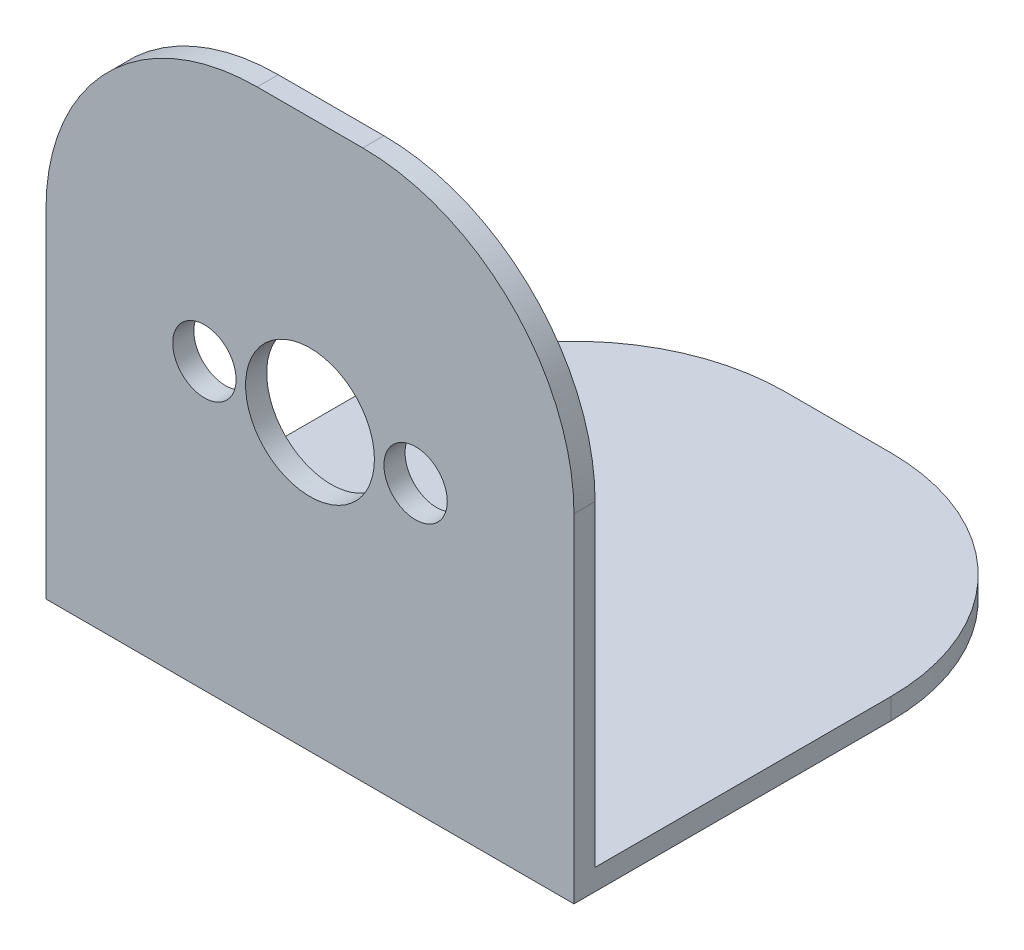
ISO-10303-21;
HEADER;
FILE_DESCRIPTION(('STEP AP214'),'2;1');
FILE_NAME('part.step','',(''),(''),'','','');
FILE_SCHEMA(('AUTOMOTIVE_DESIGN { 1 0 10303 214 1 1 1 1 }'));
ENDSEC;
DATA;
#1=APPLICATION_CONTEXT('core data for automotive mechanical design processes');
#2=APPLICATION_PROTOCOL_DEFINITION('international standard','automotive_design',2000,#1);
#3=PRODUCT_CONTEXT('',#1,'mechanical');
#4=PRODUCT('Part','Part','',(#3));
#5=PRODUCT_RELATED_PRODUCT_CATEGORY('part','',(#4));
#6=PRODUCT_DEFINITION_FORMATION('','',#4);
#7=PRODUCT_DEFINITION_CONTEXT('part definition',#1,'design');
#8=PRODUCT_DEFINITION('design','',#6,#7);
#9=PRODUCT_DEFINITION_SHAPE('','',#8);
#10=(LENGTH_UNIT() NAMED_UNIT(*) SI_UNIT(.MILLI.,.METRE.));
#11=(NAMED_UNIT(*) PLANE_ANGLE_UNIT() SI_UNIT($,.RADIAN.));
#12=(NAMED_UNIT(*) SI_UNIT($,.STERADIAN.) SOLID_ANGLE_UNIT());
#13=UNCERTAINTY_MEASURE_WITH_UNIT(LENGTH_MEASURE(1.E-05),#10,'distance_accuracy_value','');
#14=(GEOMETRIC_REPRESENTATION_CONTEXT(3) GLOBAL_UNCERTAINTY_ASSIGNED_CONTEXT((#13)) GLOBAL_UNIT_ASSIGNED_CONTEXT((#10,
#11,#12)) REPRESENTATION_CONTEXT('',''));
#15=CARTESIAN_POINT('',(0.,0.,0.));
#16=DIRECTION('',(0.,0.,1.));
#17=DIRECTION('',(1.,0.,0.));
#18=AXIS2_PLACEMENT_3D('',#15,#16,#17);
#19=CARTESIAN_POINT('',(0.,25.,1.));
#20=DIRECTION('',(0.,0.,-1.));
#21=DIRECTION('',(-1.,0.,0.));
#22=AXIS2_PLACEMENT_3D('',#19,#20,#21);
#23=PLANE('',#22);
#24=CARTESIAN_POINT('',(17.5,12.5,1.));
#25=DIRECTION('',(0.,0.,1.));
#26=DIRECTION('',(1.,0.,0.));
#27=AXIS2_PLACEMENT_3D('',#24,#25,#26);
#28=CIRCLE('',#27,1.5);
#29=CARTESIAN_POINT('',(19.,12.5,1.));
#30=VERTEX_POINT('',#29);
#31=EDGE_CURVE('E370',#30,#30,#28,.T.);
#32=ORIENTED_EDGE('',*,*,#31,.F.);
#33=EDGE_LOOP('',(#32));
#34=FACE_BOUND('',#33,.T.);
#35=DIRECTION('',(-1.,0.,0.));
#36=VECTOR('',#35,1.);
#37=CARTESIAN_POINT('',(0.,25.,1.));
#38=LINE('',#37,#36);
#39=CARTESIAN_POINT('',(15.,25.,1.));
#40=VERTEX_POINT('',#39);
#41=CARTESIAN_POINT('',(10.,25.,1.));
#42=VERTEX_POINT('',#41);
#43=EDGE_CURVE('E127',#40,#42,#38,.T.);
#44=ORIENTED_EDGE('',*,*,#43,.T.);
#45=CARTESIAN_POINT('',(10.,15.,1.));
#46=DIRECTION('',(0.,0.,-1.));
#47=DIRECTION('',(-1.,0.,0.));
#48=AXIS2_PLACEMENT_3D('',#45,#46,#47);
#49=CIRCLE('',#48,10.);
#50=CARTESIAN_POINT('',(0.,15.,1.));
#51=VERTEX_POINT('',#50);
#52=EDGE_CURVE('E11',#42,#51,#49,.F.);
#53=ORIENTED_EDGE('',*,*,#52,.T.);
#54=DIRECTION('',(0.,-1.,0.));
#55=VECTOR('',#54,1.);
#56=CARTESIAN_POINT('',(0.,0.,1.));
#57=LINE('',#56,#55);
#58=CARTESIAN_POINT('',(0.,-1.,1.));
#59=VERTEX_POINT('',#58);
#60=EDGE_CURVE('E128',#51,#59,#57,.T.);
#61=ORIENTED_EDGE('',*,*,#60,.T.);
#62=DIRECTION('',(-1.,0.,0.));
#63=VECTOR('',#62,1.);
#64=CARTESIAN_POINT('',(0.,-1.,1.));
#65=LINE('',#64,#63);
#66=CARTESIAN_POINT('',(25.,-1.,1.));
#67=VERTEX_POINT('',#66);
#68=EDGE_CURVE('E112',#67,#59,#65,.T.);
#69=ORIENTED_EDGE('',*,*,#68,.F.);
#70=DIRECTION('',(0.,1.,0.));
#71=VECTOR('',#70,1.);
#72=CARTESIAN_POINT('',(25.,0.,1.));
#73=LINE('',#72,#71);
#74=CARTESIAN_POINT('',(25.,15.,1.));
#75=VERTEX_POINT('',#74);
#76=EDGE_CURVE('E122',#67,#75,#73,.T.);
#77=ORIENTED_EDGE('',*,*,#76,.T.);
#78=CARTESIAN_POINT('',(15.,15.,1.));
#79=DIRECTION('',(0.,0.,-1.));
#80=DIRECTION('',(-1.,0.,0.));
#81=AXIS2_PLACEMENT_3D('',#78,#79,#80);
#82=CIRCLE('',#81,10.);
#83=EDGE_CURVE('E38',#75,#40,#82,.F.);
#84=ORIENTED_EDGE('',*,*,#83,.T.);
#85=EDGE_LOOP('',(#44,#53,#61,#69,#77,#84));
#86=FACE_BOUND('',#85,.T.);
#87=CARTESIAN_POINT('',(12.5,12.5,1.));
#88=DIRECTION('',(0.,0.,1.));
#89=DIRECTION('',(1.,0.,0.));
#90=AXIS2_PLACEMENT_3D('',#87,#88,#89);
#91=CIRCLE('',#90,3.05);
#92=CARTESIAN_POINT('',(15.55,12.5,1.));
#93=VERTEX_POINT('',#92);
#94=EDGE_CURVE('E166',#93,#93,#91,.T.);
#95=ORIENTED_EDGE('',*,*,#94,.F.);
#96=EDGE_LOOP('',(#95));
#97=FACE_BOUND('',#96,.T.);
#98=CARTESIAN_POINT('',(7.5,12.5,1.));
#99=DIRECTION('',(0.,0.,1.));
#100=DIRECTION('',(1.,0.,0.));
#101=AXIS2_PLACEMENT_3D('',#98,#99,#100);
#102=CIRCLE('',#101,1.5);
#103=CARTESIAN_POINT('',(9.,12.5,1.));
#104=VERTEX_POINT('',#103);
#105=EDGE_CURVE('E135',#104,#104,#102,.T.);
#106=ORIENTED_EDGE('',*,*,#105,.F.);
#107=EDGE_LOOP('',(#106));
#108=FACE_BOUND('',#107,.T.);
#109=ADVANCED_FACE('F30',(#34,#86,#97,#108),#23,.F.);
#110=CARTESIAN_POINT('',(0.,25.,0.));
#111=DIRECTION('',(0.,0.,-1.));
#112=DIRECTION('',(-1.,0.,0.));
#113=AXIS2_PLACEMENT_3D('',#110,#111,#112);
#114=PLANE('',#113);
#115=CARTESIAN_POINT('',(17.5,12.5,0.));
#116=DIRECTION('',(0.,0.,1.));
#117=DIRECTION('',(1.,0.,0.));
#118=AXIS2_PLACEMENT_3D('',#115,#116,#117);
#119=CIRCLE('',#118,1.5);
#120=CARTESIAN_POINT('',(19.,12.5,0.));
#121=VERTEX_POINT('',#120);
#122=EDGE_CURVE('E374',#121,#121,#119,.T.);
#123=ORIENTED_EDGE('',*,*,#122,.T.);
#124=EDGE_LOOP('',(#123));
#125=FACE_BOUND('',#124,.T.);
#126=DIRECTION('',(0.,-1.,0.));
#127=VECTOR('',#126,1.);
#128=CARTESIAN_POINT('',(0.,0.,0.));
#129=LINE('',#128,#127);
#130=CARTESIAN_POINT('',(0.,15.,0.));
#131=VERTEX_POINT('',#130);
#132=CARTESIAN_POINT('',(0.,0.,0.));
#133=VERTEX_POINT('',#132);
#134=EDGE_CURVE('E162',#131,#133,#129,.T.);
#135=ORIENTED_EDGE('',*,*,#134,.F.);
#136=CARTESIAN_POINT('',(10.,15.,0.));
#137=DIRECTION('',(0.,0.,-1.));
#138=DIRECTION('',(-1.,0.,0.));
#139=AXIS2_PLACEMENT_3D('',#136,#137,#138);
#140=CIRCLE('',#139,10.);
#141=CARTESIAN_POINT('',(10.,25.,0.));
#142=VERTEX_POINT('',#141);
#143=EDGE_CURVE('E202',#131,#142,#140,.T.);
#144=ORIENTED_EDGE('',*,*,#143,.T.);
#145=DIRECTION('',(-1.,0.,0.));
#146=VECTOR('',#145,1.);
#147=CARTESIAN_POINT('',(0.,25.,0.));
#148=LINE('',#147,#146);
#149=CARTESIAN_POINT('',(15.,25.,0.));
#150=VERTEX_POINT('',#149);
#151=EDGE_CURVE('E182',#150,#142,#148,.T.);
#152=ORIENTED_EDGE('',*,*,#151,.F.);
#153=CARTESIAN_POINT('',(15.,15.,0.));
#154=DIRECTION('',(0.,0.,-1.));
#155=DIRECTION('',(-1.,0.,0.));
#156=AXIS2_PLACEMENT_3D('',#153,#154,#155);
#157=CIRCLE('',#156,10.);
#158=CARTESIAN_POINT('',(25.,15.,0.));
#159=VERTEX_POINT('',#158);
#160=EDGE_CURVE('E198',#150,#159,#157,.T.);
#161=ORIENTED_EDGE('',*,*,#160,.T.);
#162=DIRECTION('',(0.,1.,0.));
#163=VECTOR('',#162,1.);
#164=CARTESIAN_POINT('',(25.,0.,0.));
#165=LINE('',#164,#163);
#166=CARTESIAN_POINT('',(25.,0.,0.));
#167=VERTEX_POINT('',#166);
#168=EDGE_CURVE('E181',#167,#159,#165,.T.);
#169=ORIENTED_EDGE('',*,*,#168,.F.);
#170=DIRECTION('',(1.,0.,0.));
#171=VECTOR('',#170,1.);
#172=CARTESIAN_POINT('',(0.,0.,0.));
#173=LINE('',#172,#171);
#174=EDGE_CURVE('E165',#133,#167,#173,.T.);
#175=ORIENTED_EDGE('',*,*,#174,.F.);
#176=EDGE_LOOP('',(#135,#144,#152,#161,#169,#175));
#177=FACE_BOUND('',#176,.T.);
#178=CARTESIAN_POINT('',(12.5,12.5,0.));
#179=DIRECTION('',(0.,0.,1.));
#180=DIRECTION('',(1.,0.,0.));
#181=AXIS2_PLACEMENT_3D('',#178,#179,#180);
#182=CIRCLE('',#181,3.05);
#183=CARTESIAN_POINT('',(15.55,12.5,0.));
#184=VERTEX_POINT('',#183);
#185=EDGE_CURVE('E369',#184,#184,#182,.T.);
#186=ORIENTED_EDGE('',*,*,#185,.T.);
#187=EDGE_LOOP('',(#186));
#188=FACE_BOUND('',#187,.T.);
#189=CARTESIAN_POINT('',(7.5,12.5,0.));
#190=DIRECTION('',(0.,0.,1.));
#191=DIRECTION('',(1.,0.,0.));
#192=AXIS2_PLACEMENT_3D('',#189,#190,#191);
#193=CIRCLE('',#192,1.5);
#194=CARTESIAN_POINT('',(9.,12.5,0.));
#195=VERTEX_POINT('',#194);
#196=EDGE_CURVE('E132',#195,#195,#193,.T.);
#197=ORIENTED_EDGE('',*,*,#196,.T.);
#198=EDGE_LOOP('',(#197));
#199=FACE_BOUND('',#198,.T.);
#200=ADVANCED_FACE('F195',(#125,#177,#188,#199),#114,.T.);
#201=CARTESIAN_POINT('',(0.,0.,1.));
#202=DIRECTION('',(1.,0.,0.));
#203=DIRECTION('',(0.,0.,-1.));
#204=AXIS2_PLACEMENT_3D('',#201,#202,#203);
#205=PLANE('',#204);
#206=DIRECTION('',(0.,0.,-1.));
#207=VECTOR('',#206,1.);
#208=CARTESIAN_POINT('',(0.,0.,1.));
#209=LINE('',#208,#207);
#210=CARTESIAN_POINT('',(0.,0.,-14.));
#211=VERTEX_POINT('',#210);
#212=EDGE_CURVE('E139',#133,#211,#209,.T.);
#213=ORIENTED_EDGE('',*,*,#212,.T.);
#214=DIRECTION('',(0.,1.,0.));
#215=VECTOR('',#214,1.);
#216=CARTESIAN_POINT('',(0.,0.,-14.));
#217=LINE('',#216,#215);
#218=CARTESIAN_POINT('',(0.,-1.,-14.));
#219=VERTEX_POINT('',#218);
#220=EDGE_CURVE('E216',#211,#219,#217,.F.);
#221=ORIENTED_EDGE('',*,*,#220,.T.);
#222=DIRECTION('',(0.,0.,-1.));
#223=VECTOR('',#222,1.);
#224=CARTESIAN_POINT('',(0.,-1.,1.));
#225=LINE('',#224,#223);
#226=EDGE_CURVE('E151',#59,#219,#225,.T.);
#227=ORIENTED_EDGE('',*,*,#226,.F.);
#228=ORIENTED_EDGE('',*,*,#60,.F.);
#229=DIRECTION('',(0.,0.,-1.));
#230=VECTOR('',#229,1.);
#231=CARTESIAN_POINT('',(0.,15.,1.));
#232=LINE('',#231,#230);
#233=EDGE_CURVE('E161',#51,#131,#232,.T.);
#234=ORIENTED_EDGE('',*,*,#233,.T.);
#235=ORIENTED_EDGE('',*,*,#134,.T.);
#236=EDGE_LOOP('',(#213,#221,#227,#228,#234,#235));
#237=FACE_BOUND('',#236,.T.);
#238=ADVANCED_FACE('F32',(#237),#205,.F.);
#239=CARTESIAN_POINT('',(25.,0.,1.));
#240=DIRECTION('',(-1.,0.,0.));
#241=DIRECTION('',(0.,0.,1.));
#242=AXIS2_PLACEMENT_3D('',#239,#240,#241);
#243=PLANE('',#242);
#244=DIRECTION('',(0.,0.,1.));
#245=VECTOR('',#244,1.);
#246=CARTESIAN_POINT('',(25.,-1.,1.));
#247=LINE('',#246,#245);
#248=CARTESIAN_POINT('',(25.,-1.,-14.));
#249=VERTEX_POINT('',#248);
#250=EDGE_CURVE('E107',#249,#67,#247,.T.);
#251=ORIENTED_EDGE('',*,*,#250,.F.);
#252=DIRECTION('',(0.,1.,0.));
#253=VECTOR('',#252,1.);
#254=CARTESIAN_POINT('',(25.,0.,-14.));
#255=LINE('',#254,#253);
#256=CARTESIAN_POINT('',(25.,0.,-14.));
#257=VERTEX_POINT('',#256);
#258=EDGE_CURVE('E203',#249,#257,#255,.T.);
#259=ORIENTED_EDGE('',*,*,#258,.T.);
#260=DIRECTION('',(0.,0.,1.));
#261=VECTOR('',#260,1.);
#262=CARTESIAN_POINT('',(25.,0.,1.));
#263=LINE('',#262,#261);
#264=EDGE_CURVE('E148',#257,#167,#263,.T.);
#265=ORIENTED_EDGE('',*,*,#264,.T.);
#266=ORIENTED_EDGE('',*,*,#168,.T.);
#267=DIRECTION('',(0.,0.,-1.));
#268=VECTOR('',#267,1.);
#269=CARTESIAN_POINT('',(25.,15.,1.));
#270=LINE('',#269,#268);
#271=EDGE_CURVE('E126',#159,#75,#270,.F.);
#272=ORIENTED_EDGE('',*,*,#271,.T.);
#273=ORIENTED_EDGE('',*,*,#76,.F.);
#274=EDGE_LOOP('',(#251,#259,#265,#266,#272,#273));
#275=FACE_BOUND('',#274,.T.);
#276=ADVANCED_FACE('F123',(#275),#243,.F.);
#277=CARTESIAN_POINT('',(0.,25.,1.));
#278=DIRECTION('',(0.,-1.,0.));
#279=DIRECTION('',(0.,0.,-1.));
#280=AXIS2_PLACEMENT_3D('',#277,#278,#279);
#281=PLANE('',#280);
#282=ORIENTED_EDGE('',*,*,#151,.T.);
#283=DIRECTION('',(0.,0.,-1.));
#284=VECTOR('',#283,1.);
#285=CARTESIAN_POINT('',(10.,25.,1.));
#286=LINE('',#285,#284);
#287=EDGE_CURVE('E45',#142,#42,#286,.F.);
#288=ORIENTED_EDGE('',*,*,#287,.T.);
#289=ORIENTED_EDGE('',*,*,#43,.F.);
#290=DIRECTION('',(0.,0.,-1.));
#291=VECTOR('',#290,1.);
#292=CARTESIAN_POINT('',(15.,25.,1.));
#293=LINE('',#292,#291);
#294=EDGE_CURVE('E205',#40,#150,#293,.T.);
#295=ORIENTED_EDGE('',*,*,#294,.T.);
#296=EDGE_LOOP('',(#282,#288,#289,#295));
#297=FACE_BOUND('',#296,.T.);
#298=ADVANCED_FACE('F211',(#297),#281,.F.);
#299=CARTESIAN_POINT('',(12.5,12.5,1.));
#300=DIRECTION('',(0.,0.,-1.));
#301=DIRECTION('',(-1.,0.,0.));
#302=AXIS2_PLACEMENT_3D('',#299,#300,#301);
#303=CYLINDRICAL_SURFACE('',#302,3.05);
#304=ORIENTED_EDGE('',*,*,#94,.T.);
#305=EDGE_LOOP('',(#304));
#306=FACE_BOUND('',#305,.T.);
#307=ORIENTED_EDGE('',*,*,#185,.F.);
#308=EDGE_LOOP('',(#307));
#309=FACE_BOUND('',#308,.T.);
#310=ADVANCED_FACE('F246',(#306,#309),#303,.F.);
#311=CARTESIAN_POINT('',(17.5,12.5,1.));
#312=DIRECTION('',(0.,0.,-1.));
#313=DIRECTION('',(-1.,0.,0.));
#314=AXIS2_PLACEMENT_3D('',#311,#312,#313);
#315=CYLINDRICAL_SURFACE('',#314,1.5);
#316=ORIENTED_EDGE('',*,*,#31,.T.);
#317=EDGE_LOOP('',(#316));
#318=FACE_BOUND('',#317,.T.);
#319=ORIENTED_EDGE('',*,*,#122,.F.);
#320=EDGE_LOOP('',(#319));
#321=FACE_BOUND('',#320,.T.);
#322=ADVANCED_FACE('F273',(#318,#321),#315,.F.);
#323=CARTESIAN_POINT('',(7.5,12.5,1.));
#324=DIRECTION('',(0.,0.,-1.));
#325=DIRECTION('',(-1.,0.,0.));
#326=AXIS2_PLACEMENT_3D('',#323,#324,#325);
#327=CYLINDRICAL_SURFACE('',#326,1.5);
#328=ORIENTED_EDGE('',*,*,#105,.T.);
#329=EDGE_LOOP('',(#328));
#330=FACE_BOUND('',#329,.T.);
#331=ORIENTED_EDGE('',*,*,#196,.F.);
#332=EDGE_LOOP('',(#331));
#333=FACE_BOUND('',#332,.T.);
#334=ADVANCED_FACE('F269',(#330,#333),#327,.F.);
#335=CARTESIAN_POINT('',(0.,0.,-24.));
#336=DIRECTION('',(0.,-1.,0.));
#337=DIRECTION('',(0.,0.,-1.));
#338=AXIS2_PLACEMENT_3D('',#335,#336,#337);
#339=PLANE('',#338);
#340=DIRECTION('',(1.,0.,0.));
#341=VECTOR('',#340,1.);
#342=CARTESIAN_POINT('',(0.,0.,-24.));
#343=LINE('',#342,#341);
#344=CARTESIAN_POINT('',(10.,0.,-24.));
#345=VERTEX_POINT('',#344);
#346=CARTESIAN_POINT('',(15.,0.,-24.));
#347=VERTEX_POINT('',#346);
#348=EDGE_CURVE('E142',#345,#347,#343,.T.);
#349=ORIENTED_EDGE('',*,*,#348,.F.);
#350=CARTESIAN_POINT('',(10.,0.,-14.));
#351=DIRECTION('',(0.,-1.,0.));
#352=DIRECTION('',(0.,0.,-1.));
#353=AXIS2_PLACEMENT_3D('',#350,#351,#352);
#354=CIRCLE('',#353,10.);
#355=EDGE_CURVE('E159',#345,#211,#354,.F.);
#356=ORIENTED_EDGE('',*,*,#355,.T.);
#357=ORIENTED_EDGE('',*,*,#212,.F.);
#358=ORIENTED_EDGE('',*,*,#174,.T.);
#359=ORIENTED_EDGE('',*,*,#264,.F.);
#360=CARTESIAN_POINT('',(15.,0.,-14.));
#361=DIRECTION('',(0.,-1.,0.));
#362=DIRECTION('',(0.,0.,-1.));
#363=AXIS2_PLACEMENT_3D('',#360,#361,#362);
#364=CIRCLE('',#363,10.);
#365=EDGE_CURVE('E157',#257,#347,#364,.F.);
#366=ORIENTED_EDGE('',*,*,#365,.T.);
#367=EDGE_LOOP('',(#349,#356,#357,#358,#359,#366));
#368=FACE_BOUND('',#367,.T.);
#369=ADVANCED_FACE('F192',(#368),#339,.F.);
#370=CARTESIAN_POINT('',(0.,-1.,-24.));
#371=DIRECTION('',(0.,0.,1.));
#372=DIRECTION('',(1.,0.,0.));
#373=AXIS2_PLACEMENT_3D('',#370,#371,#372);
#374=PLANE('',#373);
#375=DIRECTION('',(1.,0.,0.));
#376=VECTOR('',#375,1.);
#377=CARTESIAN_POINT('',(0.,-1.,-24.));
#378=LINE('',#377,#376);
#379=CARTESIAN_POINT('',(10.,-1.,-24.));
#380=VERTEX_POINT('',#379);
#381=CARTESIAN_POINT('',(15.,-1.,-24.));
#382=VERTEX_POINT('',#381);
#383=EDGE_CURVE('E120',#380,#382,#378,.T.);
#384=ORIENTED_EDGE('',*,*,#383,.F.);
#385=DIRECTION('',(0.,1.,0.));
#386=VECTOR('',#385,1.);
#387=CARTESIAN_POINT('',(10.,-1.,-24.));
#388=LINE('',#387,#386);
#389=EDGE_CURVE('E155',#380,#345,#388,.T.);
#390=ORIENTED_EDGE('',*,*,#389,.T.);
#391=ORIENTED_EDGE('',*,*,#348,.T.);
#392=DIRECTION('',(0.,1.,0.));
#393=VECTOR('',#392,1.);
#394=CARTESIAN_POINT('',(15.,-1.,-24.));
#395=LINE('',#394,#393);
#396=EDGE_CURVE('E172',#347,#382,#395,.F.);
#397=ORIENTED_EDGE('',*,*,#396,.T.);
#398=EDGE_LOOP('',(#384,#390,#391,#397));
#399=FACE_BOUND('',#398,.T.);
#400=ADVANCED_FACE('F309',(#399),#374,.F.);
#401=CARTESIAN_POINT('',(0.,-1.,-24.));
#402=DIRECTION('',(0.,-1.,0.));
#403=DIRECTION('',(0.,0.,-1.));
#404=AXIS2_PLACEMENT_3D('',#401,#402,#403);
#405=PLANE('',#404);
#406=ORIENTED_EDGE('',*,*,#226,.T.);
#407=CARTESIAN_POINT('',(10.,-1.,-14.));
#408=DIRECTION('',(0.,-1.,0.));
#409=DIRECTION('',(0.,0.,-1.));
#410=AXIS2_PLACEMENT_3D('',#407,#408,#409);
#411=CIRCLE('',#410,10.);
#412=EDGE_CURVE('E213',#219,#380,#411,.T.);
#413=ORIENTED_EDGE('',*,*,#412,.T.);
#414=ORIENTED_EDGE('',*,*,#383,.T.);
#415=CARTESIAN_POINT('',(15.,-1.,-14.));
#416=DIRECTION('',(0.,-1.,0.));
#417=DIRECTION('',(0.,0.,-1.));
#418=AXIS2_PLACEMENT_3D('',#415,#416,#417);
#419=CIRCLE('',#418,10.);
#420=EDGE_CURVE('E116',#382,#249,#419,.T.);
#421=ORIENTED_EDGE('',*,*,#420,.T.);
#422=ORIENTED_EDGE('',*,*,#250,.T.);
#423=ORIENTED_EDGE('',*,*,#68,.T.);
#424=EDGE_LOOP('',(#406,#413,#414,#421,#422,#423));
#425=FACE_BOUND('',#424,.T.);
#426=ADVANCED_FACE('F110',(#425),#405,.T.);
#427=CARTESIAN_POINT('',(10.,-1.,-14.));
#428=DIRECTION('',(0.,1.,0.));
#429=DIRECTION('',(0.,0.,1.));
#430=AXIS2_PLACEMENT_3D('',#427,#428,#429);
#431=CYLINDRICAL_SURFACE('',#430,10.);
#432=ORIENTED_EDGE('',*,*,#412,.F.);
#433=ORIENTED_EDGE('',*,*,#220,.F.);
#434=ORIENTED_EDGE('',*,*,#355,.F.);
#435=ORIENTED_EDGE('',*,*,#389,.F.);
#436=EDGE_LOOP('',(#432,#433,#434,#435));
#437=FACE_BOUND('',#436,.T.);
#438=ADVANCED_FACE('F231',(#437),#431,.T.);
#439=CARTESIAN_POINT('',(15.,0.,-14.));
#440=DIRECTION('',(0.,1.,0.));
#441=DIRECTION('',(0.,0.,1.));
#442=AXIS2_PLACEMENT_3D('',#439,#440,#441);
#443=CYLINDRICAL_SURFACE('',#442,10.);
#444=ORIENTED_EDGE('',*,*,#420,.F.);
#445=ORIENTED_EDGE('',*,*,#396,.F.);
#446=ORIENTED_EDGE('',*,*,#365,.F.);
#447=ORIENTED_EDGE('',*,*,#258,.F.);
#448=EDGE_LOOP('',(#444,#445,#446,#447));
#449=FACE_BOUND('',#448,.T.);
#450=ADVANCED_FACE('F224',(#449),#443,.T.);
#451=CARTESIAN_POINT('',(10.,15.,1.));
#452=DIRECTION('',(0.,0.,-1.));
#453=DIRECTION('',(-1.,0.,0.));
#454=AXIS2_PLACEMENT_3D('',#451,#452,#453);
#455=CYLINDRICAL_SURFACE('',#454,10.);
#456=ORIENTED_EDGE('',*,*,#52,.F.);
#457=ORIENTED_EDGE('',*,*,#287,.F.);
#458=ORIENTED_EDGE('',*,*,#143,.F.);
#459=ORIENTED_EDGE('',*,*,#233,.F.);
#460=EDGE_LOOP('',(#456,#457,#458,#459));
#461=FACE_BOUND('',#460,.T.);
#462=ADVANCED_FACE('F222',(#461),#455,.T.);
#463=CARTESIAN_POINT('',(15.,15.,1.));
#464=DIRECTION('',(0.,0.,-1.));
#465=DIRECTION('',(-1.,0.,0.));
#466=AXIS2_PLACEMENT_3D('',#463,#464,#465);
#467=CYLINDRICAL_SURFACE('',#466,10.);
#468=ORIENTED_EDGE('',*,*,#83,.F.);
#469=ORIENTED_EDGE('',*,*,#271,.F.);
#470=ORIENTED_EDGE('',*,*,#160,.F.);
#471=ORIENTED_EDGE('',*,*,#294,.F.);
#472=EDGE_LOOP('',(#468,#469,#470,#471));
#473=FACE_BOUND('',#472,.T.);
#474=ADVANCED_FACE('F212',(#473),#467,.T.);
#475=CLOSED_SHELL('',(#109,#200,#238,#276,#298,#310,#322,#334,#369,#400,#426,#438,#450,#462,#474));
#476=MANIFOLD_SOLID_BREP('B2',#475);
#477=ADVANCED_BREP_SHAPE_REPRESENTATION('',(#18,#476),#14);
#478=SHAPE_DEFINITION_REPRESENTATION(#9,#477);
ENDSEC;
END-ISO-10303-21;
